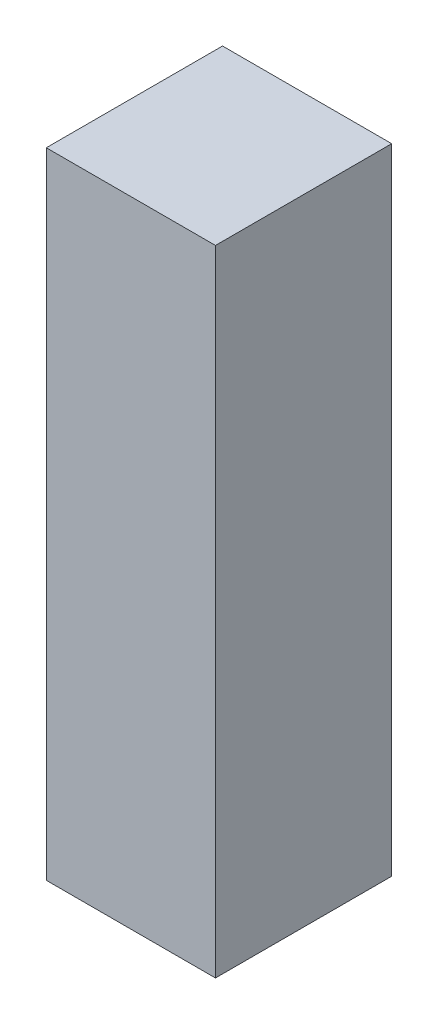
ISO-10303-21;
HEADER;
FILE_DESCRIPTION(('STEP AP214'),'2;1');
FILE_NAME('part.step','',(''),(''),'','','');
FILE_SCHEMA(('AUTOMOTIVE_DESIGN { 1 0 10303 214 1 1 1 1 }'));
ENDSEC;
DATA;
#1=APPLICATION_CONTEXT('core data for automotive mechanical design processes');
#2=APPLICATION_PROTOCOL_DEFINITION('international standard','automotive_design',2000,#1);
#3=PRODUCT_CONTEXT('',#1,'mechanical');
#4=PRODUCT('Part','Part','',(#3));
#5=PRODUCT_RELATED_PRODUCT_CATEGORY('part','',(#4));
#6=PRODUCT_DEFINITION_FORMATION('','',#4);
#7=PRODUCT_DEFINITION_CONTEXT('part definition',#1,'design');
#8=PRODUCT_DEFINITION('design','',#6,#7);
#9=PRODUCT_DEFINITION_SHAPE('','',#8);
#10=(LENGTH_UNIT() NAMED_UNIT(*) SI_UNIT(.MILLI.,.METRE.));
#11=(NAMED_UNIT(*) PLANE_ANGLE_UNIT() SI_UNIT($,.RADIAN.));
#12=(NAMED_UNIT(*) SI_UNIT($,.STERADIAN.) SOLID_ANGLE_UNIT());
#13=UNCERTAINTY_MEASURE_WITH_UNIT(LENGTH_MEASURE(1.E-05),#10,'distance_accuracy_value','');
#14=(GEOMETRIC_REPRESENTATION_CONTEXT(3) GLOBAL_UNCERTAINTY_ASSIGNED_CONTEXT((#13)) GLOBAL_UNIT_ASSIGNED_CONTEXT((#10,
#11,#12)) REPRESENTATION_CONTEXT('',''));
#15=CARTESIAN_POINT('',(0.,0.,0.));
#16=DIRECTION('',(0.,0.,1.));
#17=DIRECTION('',(1.,0.,0.));
#18=AXIS2_PLACEMENT_3D('',#15,#16,#17);
#19=CARTESIAN_POINT('',(0.,45.,0.));
#20=DIRECTION('',(1.,0.,0.));
#21=DIRECTION('',(0.,0.,-1.));
#22=AXIS2_PLACEMENT_3D('',#19,#20,#21);
#23=PLANE('',#22);
#24=DIRECTION('',(0.,0.,1.));
#25=VECTOR('',#24,1.);
#26=CARTESIAN_POINT('',(0.,0.,0.));
#27=LINE('',#26,#25);
#28=CARTESIAN_POINT('',(0.,0.,-12.5));
#29=VERTEX_POINT('',#28);
#30=CARTESIAN_POINT('',(0.,0.,0.));
#31=VERTEX_POINT('',#30);
#32=EDGE_CURVE('E113',#29,#31,#27,.T.);
#33=ORIENTED_EDGE('',*,*,#32,.T.);
#34=DIRECTION('',(0.,-1.,0.));
#35=VECTOR('',#34,1.);
#36=CARTESIAN_POINT('',(0.,45.,0.));
#37=LINE('',#36,#35);
#38=CARTESIAN_POINT('',(0.,45.,0.));
#39=VERTEX_POINT('',#38);
#40=EDGE_CURVE('E11',#39,#31,#37,.T.);
#41=ORIENTED_EDGE('',*,*,#40,.F.);
#42=DIRECTION('',(0.,0.,1.));
#43=VECTOR('',#42,1.);
#44=CARTESIAN_POINT('',(0.,45.,0.));
#45=LINE('',#44,#43);
#46=CARTESIAN_POINT('',(0.,45.,-12.5));
#47=VERTEX_POINT('',#46);
#48=EDGE_CURVE('E97',#47,#39,#45,.T.);
#49=ORIENTED_EDGE('',*,*,#48,.F.);
#50=DIRECTION('',(0.,-1.,0.));
#51=VECTOR('',#50,1.);
#52=CARTESIAN_POINT('',(0.,45.,-12.5));
#53=LINE('',#52,#51);
#54=EDGE_CURVE('E109',#47,#29,#53,.T.);
#55=ORIENTED_EDGE('',*,*,#54,.T.);
#56=EDGE_LOOP('',(#33,#41,#49,#55));
#57=FACE_BOUND('',#56,.T.);
#58=ADVANCED_FACE('F45',(#57),#23,.F.);
#59=CARTESIAN_POINT('',(0.,45.,0.));
#60=DIRECTION('',(0.,0.,-1.));
#61=DIRECTION('',(-1.,0.,0.));
#62=AXIS2_PLACEMENT_3D('',#59,#60,#61);
#63=PLANE('',#62);
#64=DIRECTION('',(1.,0.,0.));
#65=VECTOR('',#64,1.);
#66=CARTESIAN_POINT('',(0.,0.,0.));
#67=LINE('',#66,#65);
#68=CARTESIAN_POINT('',(12.,0.,0.));
#69=VERTEX_POINT('',#68);
#70=EDGE_CURVE('E102',#31,#69,#67,.T.);
#71=ORIENTED_EDGE('',*,*,#70,.T.);
#72=DIRECTION('',(0.,-1.,0.));
#73=VECTOR('',#72,1.);
#74=CARTESIAN_POINT('',(12.,45.,0.));
#75=LINE('',#74,#73);
#76=CARTESIAN_POINT('',(12.,45.,0.));
#77=VERTEX_POINT('',#76);
#78=EDGE_CURVE('E54',#77,#69,#75,.T.);
#79=ORIENTED_EDGE('',*,*,#78,.F.);
#80=DIRECTION('',(1.,0.,0.));
#81=VECTOR('',#80,1.);
#82=CARTESIAN_POINT('',(0.,45.,0.));
#83=LINE('',#82,#81);
#84=EDGE_CURVE('E92',#39,#77,#83,.T.);
#85=ORIENTED_EDGE('',*,*,#84,.F.);
#86=ORIENTED_EDGE('',*,*,#40,.T.);
#87=EDGE_LOOP('',(#71,#79,#85,#86));
#88=FACE_BOUND('',#87,.T.);
#89=ADVANCED_FACE('F101',(#88),#63,.F.);
#90=CARTESIAN_POINT('',(12.,45.,0.));
#91=DIRECTION('',(-1.,0.,0.));
#92=DIRECTION('',(0.,0.,1.));
#93=AXIS2_PLACEMENT_3D('',#90,#91,#92);
#94=PLANE('',#93);
#95=DIRECTION('',(0.,0.,-1.));
#96=VECTOR('',#95,1.);
#97=CARTESIAN_POINT('',(12.,0.,0.));
#98=LINE('',#97,#96);
#99=CARTESIAN_POINT('',(12.,0.,-12.5));
#100=VERTEX_POINT('',#99);
#101=EDGE_CURVE('E79',#69,#100,#98,.T.);
#102=ORIENTED_EDGE('',*,*,#101,.T.);
#103=DIRECTION('',(0.,-1.,0.));
#104=VECTOR('',#103,1.);
#105=CARTESIAN_POINT('',(12.,45.,-12.5));
#106=LINE('',#105,#104);
#107=CARTESIAN_POINT('',(12.,45.,-12.5));
#108=VERTEX_POINT('',#107);
#109=EDGE_CURVE('E104',#108,#100,#106,.T.);
#110=ORIENTED_EDGE('',*,*,#109,.F.);
#111=DIRECTION('',(0.,0.,-1.));
#112=VECTOR('',#111,1.);
#113=CARTESIAN_POINT('',(12.,45.,0.));
#114=LINE('',#113,#112);
#115=EDGE_CURVE('E95',#77,#108,#114,.T.);
#116=ORIENTED_EDGE('',*,*,#115,.F.);
#117=ORIENTED_EDGE('',*,*,#78,.T.);
#118=EDGE_LOOP('',(#102,#110,#116,#117));
#119=FACE_BOUND('',#118,.T.);
#120=ADVANCED_FACE('F105',(#119),#94,.F.);
#121=CARTESIAN_POINT('',(0.,45.,-12.5));
#122=DIRECTION('',(0.,0.,1.));
#123=DIRECTION('',(1.,0.,0.));
#124=AXIS2_PLACEMENT_3D('',#121,#122,#123);
#125=PLANE('',#124);
#126=DIRECTION('',(-1.,0.,0.));
#127=VECTOR('',#126,1.);
#128=CARTESIAN_POINT('',(0.,0.,-12.5));
#129=LINE('',#128,#127);
#130=EDGE_CURVE('E85',#100,#29,#129,.T.);
#131=ORIENTED_EDGE('',*,*,#130,.T.);
#132=ORIENTED_EDGE('',*,*,#54,.F.);
#133=DIRECTION('',(-1.,0.,0.));
#134=VECTOR('',#133,1.);
#135=CARTESIAN_POINT('',(0.,45.,-12.5));
#136=LINE('',#135,#134);
#137=EDGE_CURVE('E62',#108,#47,#136,.T.);
#138=ORIENTED_EDGE('',*,*,#137,.F.);
#139=ORIENTED_EDGE('',*,*,#109,.T.);
#140=EDGE_LOOP('',(#131,#132,#138,#139));
#141=FACE_BOUND('',#140,.T.);
#142=ADVANCED_FACE('F126',(#141),#125,.F.);
#143=CARTESIAN_POINT('',(0.,45.,0.));
#144=DIRECTION('',(0.,-1.,0.));
#145=DIRECTION('',(0.,0.,-1.));
#146=AXIS2_PLACEMENT_3D('',#143,#144,#145);
#147=PLANE('',#146);
#148=ORIENTED_EDGE('',*,*,#48,.T.);
#149=ORIENTED_EDGE('',*,*,#84,.T.);
#150=ORIENTED_EDGE('',*,*,#115,.T.);
#151=ORIENTED_EDGE('',*,*,#137,.T.);
#152=EDGE_LOOP('',(#148,#149,#150,#151));
#153=FACE_BOUND('',#152,.T.);
#154=ADVANCED_FACE('F93',(#153),#147,.F.);
#155=CARTESIAN_POINT('',(0.,0.,0.));
#156=DIRECTION('',(0.,-1.,0.));
#157=DIRECTION('',(0.,0.,-1.));
#158=AXIS2_PLACEMENT_3D('',#155,#156,#157);
#159=PLANE('',#158);
#160=ORIENTED_EDGE('',*,*,#32,.F.);
#161=ORIENTED_EDGE('',*,*,#130,.F.);
#162=ORIENTED_EDGE('',*,*,#101,.F.);
#163=ORIENTED_EDGE('',*,*,#70,.F.);
#164=EDGE_LOOP('',(#160,#161,#162,#163));
#165=FACE_BOUND('',#164,.T.);
#166=ADVANCED_FACE('F129',(#165),#159,.T.);
#167=CLOSED_SHELL('',(#58,#89,#120,#142,#154,#166));
#168=MANIFOLD_SOLID_BREP('B2',#167);
#169=ADVANCED_BREP_SHAPE_REPRESENTATION('',(#18,#168),#14);
#170=SHAPE_DEFINITION_REPRESENTATION(#9,#169);
ENDSEC;
END-ISO-10303-21;
